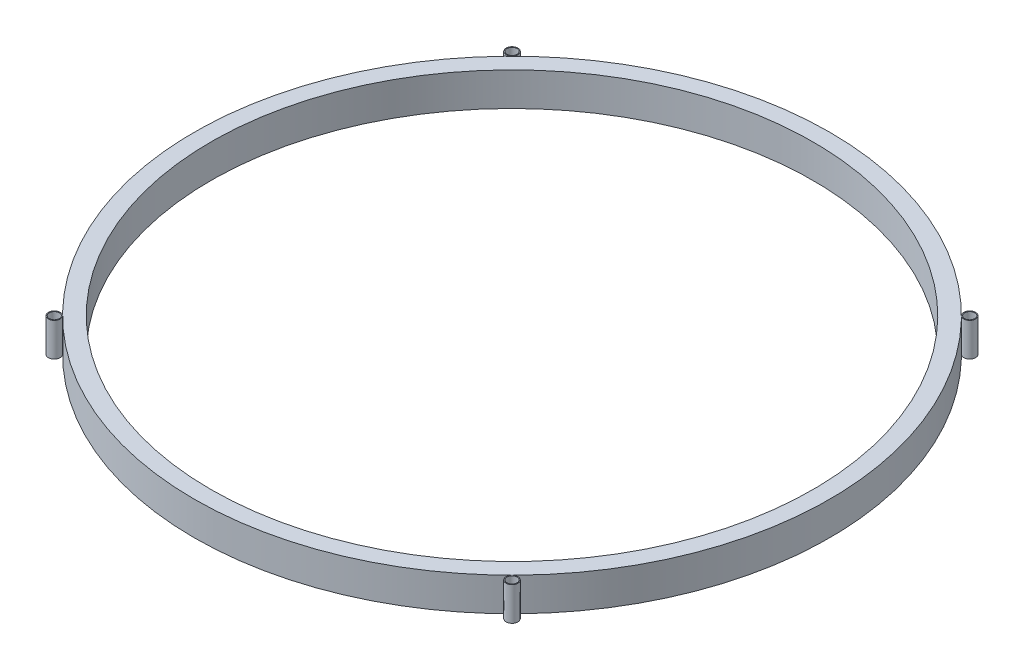
ISO-10303-21;
HEADER;
FILE_DESCRIPTION(('STEP AP214'),'2;1');
FILE_NAME('part.step','',(''),(''),'','','');
FILE_SCHEMA(('AUTOMOTIVE_DESIGN { 1 0 10303 214 1 1 1 1 }'));
ENDSEC;
DATA;
#1=APPLICATION_CONTEXT('core data for automotive mechanical design processes');
#2=APPLICATION_PROTOCOL_DEFINITION('international standard','automotive_design',2000,#1);
#3=PRODUCT_CONTEXT('',#1,'mechanical');
#4=PRODUCT('Part','Part','',(#3));
#5=PRODUCT_RELATED_PRODUCT_CATEGORY('part','',(#4));
#6=PRODUCT_DEFINITION_FORMATION('','',#4);
#7=PRODUCT_DEFINITION_CONTEXT('part definition',#1,'design');
#8=PRODUCT_DEFINITION('design','',#6,#7);
#9=PRODUCT_DEFINITION_SHAPE('','',#8);
#10=(LENGTH_UNIT() NAMED_UNIT(*) SI_UNIT(.MILLI.,.METRE.));
#11=(NAMED_UNIT(*) PLANE_ANGLE_UNIT() SI_UNIT($,.RADIAN.));
#12=(NAMED_UNIT(*) SI_UNIT($,.STERADIAN.) SOLID_ANGLE_UNIT());
#13=UNCERTAINTY_MEASURE_WITH_UNIT(LENGTH_MEASURE(1.E-05),#10,'distance_accuracy_value','');
#14=(GEOMETRIC_REPRESENTATION_CONTEXT(3) GLOBAL_UNCERTAINTY_ASSIGNED_CONTEXT((#13)) GLOBAL_UNIT_ASSIGNED_CONTEXT((#10,
#11,#12)) REPRESENTATION_CONTEXT('',''));
#15=CARTESIAN_POINT('',(0.,0.,0.));
#16=DIRECTION('',(0.,0.,1.));
#17=DIRECTION('',(1.,0.,0.));
#18=AXIS2_PLACEMENT_3D('',#15,#16,#17);
#19=CARTESIAN_POINT('',(68.4125810797987,10.,-68.4125810797983));
#20=DIRECTION('',(0.,1.,0.));
#21=DIRECTION('',(0.,0.,1.));
#22=AXIS2_PLACEMENT_3D('',#19,#20,#21);
#23=PLANE('',#22);
#24=CARTESIAN_POINT('',(68.4125810797987,10.,-68.4125810797983));
#25=DIRECTION('',(0.,1.,0.));
#26=DIRECTION('',(0.,0.,1.));
#27=AXIS2_PLACEMENT_3D('',#24,#25,#26);
#28=CIRCLE('',#27,1.74999999999997);
#29=CARTESIAN_POINT('',(68.4125810797987,10.,-66.6625810797983));
#30=VERTEX_POINT('',#29);
#31=EDGE_CURVE('E128',#30,#30,#28,.T.);
#32=ORIENTED_EDGE('',*,*,#31,.T.);
#33=EDGE_LOOP('',(#32));
#34=FACE_BOUND('',#33,.T.);
#35=CARTESIAN_POINT('',(68.4125810797987,10.,-68.4125810797983));
#36=DIRECTION('',(0.,1.,0.));
#37=DIRECTION('',(0.,0.,1.));
#38=AXIS2_PLACEMENT_3D('',#35,#36,#37);
#39=CIRCLE('',#38,1.49999999999997);
#40=CARTESIAN_POINT('',(68.4125810797987,10.,-66.9125810797983));
#41=VERTEX_POINT('',#40);
#42=EDGE_CURVE('E119',#41,#41,#39,.T.);
#43=ORIENTED_EDGE('',*,*,#42,.F.);
#44=EDGE_LOOP('',(#43));
#45=FACE_BOUND('',#44,.T.);
#46=ADVANCED_FACE('F115',(#34,#45),#23,.T.);
#47=CARTESIAN_POINT('',(68.4125810797987,0.,-68.4125810797983));
#48=DIRECTION('',(0.,1.,0.));
#49=DIRECTION('',(0.,0.,1.));
#50=AXIS2_PLACEMENT_3D('',#47,#48,#49);
#51=PLANE('',#50);
#52=CARTESIAN_POINT('',(68.4125810797987,0.,-68.4125810797983));
#53=DIRECTION('',(0.,1.,0.));
#54=DIRECTION('',(0.,0.,1.));
#55=AXIS2_PLACEMENT_3D('',#52,#53,#54);
#56=CIRCLE('',#55,1.74999999999997);
#57=CARTESIAN_POINT('',(68.4125810797987,0.,-66.6625810797983));
#58=VERTEX_POINT('',#57);
#59=EDGE_CURVE('E126',#58,#58,#56,.T.);
#60=ORIENTED_EDGE('',*,*,#59,.F.);
#61=EDGE_LOOP('',(#60));
#62=FACE_BOUND('',#61,.T.);
#63=CARTESIAN_POINT('',(68.4125810797987,0.,-68.4125810797983));
#64=DIRECTION('',(0.,1.,0.));
#65=DIRECTION('',(0.,0.,1.));
#66=AXIS2_PLACEMENT_3D('',#63,#64,#65);
#67=CIRCLE('',#66,1.49999999999997);
#68=CARTESIAN_POINT('',(68.4125810797987,0.,-66.9125810797983));
#69=VERTEX_POINT('',#68);
#70=EDGE_CURVE('E12',#69,#69,#67,.T.);
#71=ORIENTED_EDGE('',*,*,#70,.T.);
#72=EDGE_LOOP('',(#71));
#73=FACE_BOUND('',#72,.T.);
#74=ADVANCED_FACE('F137',(#62,#73),#51,.F.);
#75=CARTESIAN_POINT('',(68.4125810797987,10.,-68.4125810797983));
#76=DIRECTION('',(0.,-1.,0.));
#77=DIRECTION('',(0.,0.,-1.));
#78=AXIS2_PLACEMENT_3D('',#75,#76,#77);
#79=CYLINDRICAL_SURFACE('',#78,1.74999999999997);
#80=ORIENTED_EDGE('',*,*,#59,.T.);
#81=EDGE_LOOP('',(#80));
#82=FACE_BOUND('',#81,.T.);
#83=ORIENTED_EDGE('',*,*,#31,.F.);
#84=EDGE_LOOP('',(#83));
#85=FACE_BOUND('',#84,.T.);
#86=ADVANCED_FACE('F134',(#82,#85),#79,.T.);
#87=CARTESIAN_POINT('',(68.4125810797987,10.,-68.4125810797983));
#88=DIRECTION('',(0.,-1.,0.));
#89=DIRECTION('',(0.,0.,-1.));
#90=AXIS2_PLACEMENT_3D('',#87,#88,#89);
#91=CYLINDRICAL_SURFACE('',#90,1.49999999999997);
#92=ORIENTED_EDGE('',*,*,#42,.T.);
#93=EDGE_LOOP('',(#92));
#94=FACE_BOUND('',#93,.T.);
#95=ORIENTED_EDGE('',*,*,#70,.F.);
#96=EDGE_LOOP('',(#95));
#97=FACE_BOUND('',#96,.T.);
#98=ADVANCED_FACE('F117',(#94,#97),#91,.F.);
#99=CLOSED_SHELL('',(#46,#74,#86,#98));
#100=MANIFOLD_SOLID_BREP('B2',#99);
#101=CARTESIAN_POINT('',(-68.4125810797983,10.,-68.4125810797987));
#102=DIRECTION('',(0.,1.,0.));
#103=DIRECTION('',(0.,0.,1.));
#104=AXIS2_PLACEMENT_3D('',#101,#102,#103);
#105=PLANE('',#104);
#106=CARTESIAN_POINT('',(-68.4125810797983,10.,-68.4125810797987));
#107=DIRECTION('',(0.,1.,0.));
#108=DIRECTION('',(0.,0.,1.));
#109=AXIS2_PLACEMENT_3D('',#106,#107,#108);
#110=CIRCLE('',#109,1.75);
#111=CARTESIAN_POINT('',(-68.4125810797983,10.,-66.6625810797987));
#112=VERTEX_POINT('',#111);
#113=EDGE_CURVE('E197',#112,#112,#110,.T.);
#114=ORIENTED_EDGE('',*,*,#113,.T.);
#115=EDGE_LOOP('',(#114));
#116=FACE_BOUND('',#115,.T.);
#117=CARTESIAN_POINT('',(-68.4125810797983,10.,-68.4125810797987));
#118=DIRECTION('',(0.,1.,0.));
#119=DIRECTION('',(0.,0.,1.));
#120=AXIS2_PLACEMENT_3D('',#117,#118,#119);
#121=CIRCLE('',#120,1.5);
#122=CARTESIAN_POINT('',(-68.4125810797983,10.,-66.9125810797987));
#123=VERTEX_POINT('',#122);
#124=EDGE_CURVE('E188',#123,#123,#121,.T.);
#125=ORIENTED_EDGE('',*,*,#124,.F.);
#126=EDGE_LOOP('',(#125));
#127=FACE_BOUND('',#126,.T.);
#128=ADVANCED_FACE('F184',(#116,#127),#105,.T.);
#129=CARTESIAN_POINT('',(-68.4125810797983,0.,-68.4125810797987));
#130=DIRECTION('',(0.,1.,0.));
#131=DIRECTION('',(0.,0.,1.));
#132=AXIS2_PLACEMENT_3D('',#129,#130,#131);
#133=PLANE('',#132);
#134=CARTESIAN_POINT('',(-68.4125810797983,0.,-68.4125810797987));
#135=DIRECTION('',(0.,1.,0.));
#136=DIRECTION('',(0.,0.,1.));
#137=AXIS2_PLACEMENT_3D('',#134,#135,#136);
#138=CIRCLE('',#137,1.75);
#139=CARTESIAN_POINT('',(-68.4125810797983,0.,-66.6625810797987));
#140=VERTEX_POINT('',#139);
#141=EDGE_CURVE('E195',#140,#140,#138,.T.);
#142=ORIENTED_EDGE('',*,*,#141,.F.);
#143=EDGE_LOOP('',(#142));
#144=FACE_BOUND('',#143,.T.);
#145=CARTESIAN_POINT('',(-68.4125810797983,0.,-68.4125810797987));
#146=DIRECTION('',(0.,1.,0.));
#147=DIRECTION('',(0.,0.,1.));
#148=AXIS2_PLACEMENT_3D('',#145,#146,#147);
#149=CIRCLE('',#148,1.5);
#150=CARTESIAN_POINT('',(-68.4125810797983,0.,-66.9125810797987));
#151=VERTEX_POINT('',#150);
#152=EDGE_CURVE('E114',#151,#151,#149,.T.);
#153=ORIENTED_EDGE('',*,*,#152,.T.);
#154=EDGE_LOOP('',(#153));
#155=FACE_BOUND('',#154,.T.);
#156=ADVANCED_FACE('F206',(#144,#155),#133,.F.);
#157=CARTESIAN_POINT('',(-68.4125810797983,10.,-68.4125810797987));
#158=DIRECTION('',(0.,-1.,0.));
#159=DIRECTION('',(0.,0.,-1.));
#160=AXIS2_PLACEMENT_3D('',#157,#158,#159);
#161=CYLINDRICAL_SURFACE('',#160,1.75);
#162=ORIENTED_EDGE('',*,*,#141,.T.);
#163=EDGE_LOOP('',(#162));
#164=FACE_BOUND('',#163,.T.);
#165=ORIENTED_EDGE('',*,*,#113,.F.);
#166=EDGE_LOOP('',(#165));
#167=FACE_BOUND('',#166,.T.);
#168=ADVANCED_FACE('F203',(#164,#167),#161,.T.);
#169=CARTESIAN_POINT('',(-68.4125810797983,10.,-68.4125810797987));
#170=DIRECTION('',(0.,-1.,0.));
#171=DIRECTION('',(0.,0.,-1.));
#172=AXIS2_PLACEMENT_3D('',#169,#170,#171);
#173=CYLINDRICAL_SURFACE('',#172,1.5);
#174=ORIENTED_EDGE('',*,*,#124,.T.);
#175=EDGE_LOOP('',(#174));
#176=FACE_BOUND('',#175,.T.);
#177=ORIENTED_EDGE('',*,*,#152,.F.);
#178=EDGE_LOOP('',(#177));
#179=FACE_BOUND('',#178,.T.);
#180=ADVANCED_FACE('F186',(#176,#179),#173,.F.);
#181=CLOSED_SHELL('',(#128,#156,#168,#180));
#182=MANIFOLD_SOLID_BREP('B7',#181);
#183=CARTESIAN_POINT('',(0.,10.,0.));
#184=DIRECTION('',(0.,-1.,0.));
#185=DIRECTION('',(0.,0.,-1.));
#186=AXIS2_PLACEMENT_3D('',#183,#184,#185);
#187=CYLINDRICAL_SURFACE('',#186,95.);
#188=CARTESIAN_POINT('',(0.,0.,0.));
#189=DIRECTION('',(0.,1.,0.));
#190=DIRECTION('',(0.,0.,1.));
#191=AXIS2_PLACEMENT_3D('',#188,#189,#190);
#192=CIRCLE('',#191,95.);
#193=CARTESIAN_POINT('',(0.,0.,95.));
#194=VERTEX_POINT('',#193);
#195=EDGE_CURVE('E261',#194,#194,#192,.T.);
#196=ORIENTED_EDGE('',*,*,#195,.T.);
#197=EDGE_LOOP('',(#196));
#198=FACE_BOUND('',#197,.T.);
#199=CARTESIAN_POINT('',(0.,10.,0.));
#200=DIRECTION('',(0.,1.,0.));
#201=DIRECTION('',(0.,0.,1.));
#202=AXIS2_PLACEMENT_3D('',#199,#200,#201);
#203=CIRCLE('',#202,95.);
#204=CARTESIAN_POINT('',(0.,10.,95.));
#205=VERTEX_POINT('',#204);
#206=EDGE_CURVE('E267',#205,#205,#203,.T.);
#207=ORIENTED_EDGE('',*,*,#206,.F.);
#208=EDGE_LOOP('',(#207));
#209=FACE_BOUND('',#208,.T.);
#210=ADVANCED_FACE('F253',(#198,#209),#187,.T.);
#211=CARTESIAN_POINT('',(0.,10.,0.));
#212=DIRECTION('',(0.,-1.,0.));
#213=DIRECTION('',(0.,0.,-1.));
#214=AXIS2_PLACEMENT_3D('',#211,#212,#213);
#215=CYLINDRICAL_SURFACE('',#214,90.);
#216=CARTESIAN_POINT('',(0.,10.,0.));
#217=DIRECTION('',(0.,1.,0.));
#218=DIRECTION('',(0.,0.,1.));
#219=AXIS2_PLACEMENT_3D('',#216,#217,#218);
#220=CIRCLE('',#219,90.);
#221=CARTESIAN_POINT('',(0.,10.,90.));
#222=VERTEX_POINT('',#221);
#223=EDGE_CURVE('E257',#222,#222,#220,.T.);
#224=ORIENTED_EDGE('',*,*,#223,.T.);
#225=EDGE_LOOP('',(#224));
#226=FACE_BOUND('',#225,.T.);
#227=CARTESIAN_POINT('',(0.,0.,0.));
#228=DIRECTION('',(0.,1.,0.));
#229=DIRECTION('',(0.,0.,1.));
#230=AXIS2_PLACEMENT_3D('',#227,#228,#229);
#231=CIRCLE('',#230,90.);
#232=CARTESIAN_POINT('',(0.,0.,90.));
#233=VERTEX_POINT('',#232);
#234=EDGE_CURVE('E183',#233,#233,#231,.T.);
#235=ORIENTED_EDGE('',*,*,#234,.F.);
#236=EDGE_LOOP('',(#235));
#237=FACE_BOUND('',#236,.T.);
#238=ADVANCED_FACE('F274',(#226,#237),#215,.F.);
#239=CARTESIAN_POINT('',(0.,10.,0.));
#240=DIRECTION('',(0.,1.,0.));
#241=DIRECTION('',(0.,0.,1.));
#242=AXIS2_PLACEMENT_3D('',#239,#240,#241);
#243=PLANE('',#242);
#244=ORIENTED_EDGE('',*,*,#223,.F.);
#245=EDGE_LOOP('',(#244));
#246=FACE_BOUND('',#245,.T.);
#247=ORIENTED_EDGE('',*,*,#206,.T.);
#248=EDGE_LOOP('',(#247));
#249=FACE_BOUND('',#248,.T.);
#250=ADVANCED_FACE('F255',(#246,#249),#243,.T.);
#251=CARTESIAN_POINT('',(0.,0.,0.));
#252=DIRECTION('',(0.,1.,0.));
#253=DIRECTION('',(0.,0.,1.));
#254=AXIS2_PLACEMENT_3D('',#251,#252,#253);
#255=PLANE('',#254);
#256=ORIENTED_EDGE('',*,*,#234,.T.);
#257=EDGE_LOOP('',(#256));
#258=FACE_BOUND('',#257,.T.);
#259=ORIENTED_EDGE('',*,*,#195,.F.);
#260=EDGE_LOOP('',(#259));
#261=FACE_BOUND('',#260,.T.);
#262=ADVANCED_FACE('F278',(#258,#261),#255,.F.);
#263=CLOSED_SHELL('',(#210,#238,#250,#262));
#264=MANIFOLD_SOLID_BREP('B109',#263);
#265=CARTESIAN_POINT('',(-68.4125810797987,10.,68.4125810797983));
#266=DIRECTION('',(0.,1.,0.));
#267=DIRECTION('',(0.,0.,1.));
#268=AXIS2_PLACEMENT_3D('',#265,#266,#267);
#269=PLANE('',#268);
#270=CARTESIAN_POINT('',(-68.4125810797987,10.,68.4125810797983));
#271=DIRECTION('',(0.,1.,0.));
#272=DIRECTION('',(0.,0.,1.));
#273=AXIS2_PLACEMENT_3D('',#270,#271,#272);
#274=CIRCLE('',#273,1.75);
#275=CARTESIAN_POINT('',(-68.4125810797987,10.,70.1625810797983));
#276=VERTEX_POINT('',#275);
#277=EDGE_CURVE('E334',#276,#276,#274,.T.);
#278=ORIENTED_EDGE('',*,*,#277,.T.);
#279=EDGE_LOOP('',(#278));
#280=FACE_BOUND('',#279,.T.);
#281=CARTESIAN_POINT('',(-68.4125810797987,10.,68.4125810797983));
#282=DIRECTION('',(0.,1.,0.));
#283=DIRECTION('',(0.,0.,1.));
#284=AXIS2_PLACEMENT_3D('',#281,#282,#283);
#285=CIRCLE('',#284,1.5);
#286=CARTESIAN_POINT('',(-68.4125810797987,10.,69.9125810797983));
#287=VERTEX_POINT('',#286);
#288=EDGE_CURVE('E325',#287,#287,#285,.T.);
#289=ORIENTED_EDGE('',*,*,#288,.F.);
#290=EDGE_LOOP('',(#289));
#291=FACE_BOUND('',#290,.T.);
#292=ADVANCED_FACE('F321',(#280,#291),#269,.T.);
#293=CARTESIAN_POINT('',(-68.4125810797987,0.,68.4125810797983));
#294=DIRECTION('',(0.,1.,0.));
#295=DIRECTION('',(0.,0.,1.));
#296=AXIS2_PLACEMENT_3D('',#293,#294,#295);
#297=PLANE('',#296);
#298=CARTESIAN_POINT('',(-68.4125810797987,0.,68.4125810797983));
#299=DIRECTION('',(0.,1.,0.));
#300=DIRECTION('',(0.,0.,1.));
#301=AXIS2_PLACEMENT_3D('',#298,#299,#300);
#302=CIRCLE('',#301,1.75);
#303=CARTESIAN_POINT('',(-68.4125810797987,0.,70.1625810797983));
#304=VERTEX_POINT('',#303);
#305=EDGE_CURVE('E332',#304,#304,#302,.T.);
#306=ORIENTED_EDGE('',*,*,#305,.F.);
#307=EDGE_LOOP('',(#306));
#308=FACE_BOUND('',#307,.T.);
#309=CARTESIAN_POINT('',(-68.4125810797987,0.,68.4125810797983));
#310=DIRECTION('',(0.,1.,0.));
#311=DIRECTION('',(0.,0.,1.));
#312=AXIS2_PLACEMENT_3D('',#309,#310,#311);
#313=CIRCLE('',#312,1.5);
#314=CARTESIAN_POINT('',(-68.4125810797987,0.,69.9125810797983));
#315=VERTEX_POINT('',#314);
#316=EDGE_CURVE('E252',#315,#315,#313,.T.);
#317=ORIENTED_EDGE('',*,*,#316,.T.);
#318=EDGE_LOOP('',(#317));
#319=FACE_BOUND('',#318,.T.);
#320=ADVANCED_FACE('F343',(#308,#319),#297,.F.);
#321=CARTESIAN_POINT('',(-68.4125810797987,10.,68.4125810797983));
#322=DIRECTION('',(0.,-1.,0.));
#323=DIRECTION('',(0.,0.,-1.));
#324=AXIS2_PLACEMENT_3D('',#321,#322,#323);
#325=CYLINDRICAL_SURFACE('',#324,1.75);
#326=ORIENTED_EDGE('',*,*,#305,.T.);
#327=EDGE_LOOP('',(#326));
#328=FACE_BOUND('',#327,.T.);
#329=ORIENTED_EDGE('',*,*,#277,.F.);
#330=EDGE_LOOP('',(#329));
#331=FACE_BOUND('',#330,.T.);
#332=ADVANCED_FACE('F340',(#328,#331),#325,.T.);
#333=CARTESIAN_POINT('',(-68.4125810797987,10.,68.4125810797983));
#334=DIRECTION('',(0.,-1.,0.));
#335=DIRECTION('',(0.,0.,-1.));
#336=AXIS2_PLACEMENT_3D('',#333,#334,#335);
#337=CYLINDRICAL_SURFACE('',#336,1.5);
#338=ORIENTED_EDGE('',*,*,#288,.T.);
#339=EDGE_LOOP('',(#338));
#340=FACE_BOUND('',#339,.T.);
#341=ORIENTED_EDGE('',*,*,#316,.F.);
#342=EDGE_LOOP('',(#341));
#343=FACE_BOUND('',#342,.T.);
#344=ADVANCED_FACE('F323',(#340,#343),#337,.F.);
#345=CLOSED_SHELL('',(#292,#320,#332,#344));
#346=MANIFOLD_SOLID_BREP('B178',#345);
#347=CARTESIAN_POINT('',(68.4125810797983,10.,68.4125810797987));
#348=DIRECTION('',(0.,1.,0.));
#349=DIRECTION('',(0.,0.,1.));
#350=AXIS2_PLACEMENT_3D('',#347,#348,#349);
#351=PLANE('',#350);
#352=CARTESIAN_POINT('',(68.4125810797983,10.,68.4125810797987));
#353=DIRECTION('',(0.,1.,0.));
#354=DIRECTION('',(0.,0.,1.));
#355=AXIS2_PLACEMENT_3D('',#352,#353,#354);
#356=CIRCLE('',#355,1.75000000000001);
#357=CARTESIAN_POINT('',(68.4125810797983,10.,70.1625810797987));
#358=VERTEX_POINT('',#357);
#359=EDGE_CURVE('E320',#358,#358,#356,.T.);
#360=ORIENTED_EDGE('',*,*,#359,.T.);
#361=EDGE_LOOP('',(#360));
#362=FACE_BOUND('',#361,.T.);
#363=CARTESIAN_POINT('',(68.4125810797983,10.,68.4125810797987));
#364=DIRECTION('',(0.,1.,0.));
#365=DIRECTION('',(0.,0.,1.));
#366=AXIS2_PLACEMENT_3D('',#363,#364,#365);
#367=CIRCLE('',#366,1.5);
#368=CARTESIAN_POINT('',(68.4125810797983,10.,69.9125810797987));
#369=VERTEX_POINT('',#368);
#370=EDGE_CURVE('E393',#369,#369,#367,.T.);
#371=ORIENTED_EDGE('',*,*,#370,.F.);
#372=EDGE_LOOP('',(#371));
#373=FACE_BOUND('',#372,.T.);
#374=ADVANCED_FACE('F382',(#362,#373),#351,.T.);
#375=CARTESIAN_POINT('',(68.4125810797983,0.,68.4125810797987));
#376=DIRECTION('',(0.,1.,0.));
#377=DIRECTION('',(0.,0.,1.));
#378=AXIS2_PLACEMENT_3D('',#375,#376,#377);
#379=PLANE('',#378);
#380=CARTESIAN_POINT('',(68.4125810797983,0.,68.4125810797987));
#381=DIRECTION('',(0.,1.,0.));
#382=DIRECTION('',(0.,0.,1.));
#383=AXIS2_PLACEMENT_3D('',#380,#381,#382);
#384=CIRCLE('',#383,1.75000000000001);
#385=CARTESIAN_POINT('',(68.4125810797983,0.,70.1625810797987));
#386=VERTEX_POINT('',#385);
#387=EDGE_CURVE('E386',#386,#386,#384,.T.);
#388=ORIENTED_EDGE('',*,*,#387,.F.);
#389=EDGE_LOOP('',(#388));
#390=FACE_BOUND('',#389,.T.);
#391=CARTESIAN_POINT('',(68.4125810797983,0.,68.4125810797987));
#392=DIRECTION('',(0.,1.,0.));
#393=DIRECTION('',(0.,0.,1.));
#394=AXIS2_PLACEMENT_3D('',#391,#392,#393);
#395=CIRCLE('',#394,1.5);
#396=CARTESIAN_POINT('',(68.4125810797983,0.,69.9125810797987));
#397=VERTEX_POINT('',#396);
#398=EDGE_CURVE('E395',#397,#397,#395,.T.);
#399=ORIENTED_EDGE('',*,*,#398,.T.);
#400=EDGE_LOOP('',(#399));
#401=FACE_BOUND('',#400,.T.);
#402=ADVANCED_FACE('F405',(#390,#401),#379,.F.);
#403=CARTESIAN_POINT('',(68.4125810797983,10.,68.4125810797987));
#404=DIRECTION('',(0.,-1.,0.));
#405=DIRECTION('',(0.,0.,-1.));
#406=AXIS2_PLACEMENT_3D('',#403,#404,#405);
#407=CYLINDRICAL_SURFACE('',#406,1.75000000000001);
#408=ORIENTED_EDGE('',*,*,#387,.T.);
#409=EDGE_LOOP('',(#408));
#410=FACE_BOUND('',#409,.T.);
#411=ORIENTED_EDGE('',*,*,#359,.F.);
#412=EDGE_LOOP('',(#411));
#413=FACE_BOUND('',#412,.T.);
#414=ADVANCED_FACE('F384',(#410,#413),#407,.T.);
#415=CARTESIAN_POINT('',(68.4125810797983,10.,68.4125810797987));
#416=DIRECTION('',(0.,-1.,0.));
#417=DIRECTION('',(0.,0.,-1.));
#418=AXIS2_PLACEMENT_3D('',#415,#416,#417);
#419=CYLINDRICAL_SURFACE('',#418,1.5);
#420=ORIENTED_EDGE('',*,*,#370,.T.);
#421=EDGE_LOOP('',(#420));
#422=FACE_BOUND('',#421,.T.);
#423=ORIENTED_EDGE('',*,*,#398,.F.);
#424=EDGE_LOOP('',(#423));
#425=FACE_BOUND('',#424,.T.);
#426=ADVANCED_FACE('F401',(#422,#425),#419,.F.);
#427=CLOSED_SHELL('',(#374,#402,#414,#426));
#428=MANIFOLD_SOLID_BREP('B247',#427);
#429=ADVANCED_BREP_SHAPE_REPRESENTATION('',(#18,#100,#182,#264,#346,#428),#14);
#430=SHAPE_DEFINITION_REPRESENTATION(#9,#429);
ENDSEC;
END-ISO-10303-21;
